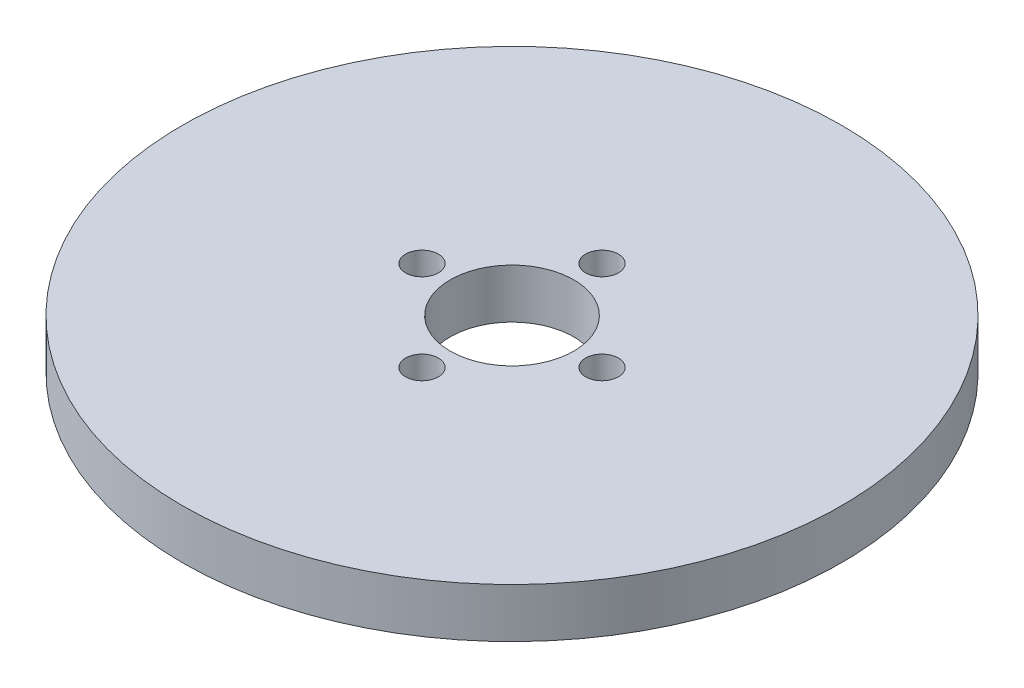
ISO-10303-21;
HEADER;
FILE_DESCRIPTION(('STEP AP214'),'2;1');
FILE_NAME('part.step','',(''),(''),'','','');
FILE_SCHEMA(('AUTOMOTIVE_DESIGN { 1 0 10303 214 1 1 1 1 }'));
ENDSEC;
DATA;
#1=APPLICATION_CONTEXT('core data for automotive mechanical design processes');
#2=APPLICATION_PROTOCOL_DEFINITION('international standard','automotive_design',2000,#1);
#3=PRODUCT_CONTEXT('',#1,'mechanical');
#4=PRODUCT('Part','Part','',(#3));
#5=PRODUCT_RELATED_PRODUCT_CATEGORY('part','',(#4));
#6=PRODUCT_DEFINITION_FORMATION('','',#4);
#7=PRODUCT_DEFINITION_CONTEXT('part definition',#1,'design');
#8=PRODUCT_DEFINITION('design','',#6,#7);
#9=PRODUCT_DEFINITION_SHAPE('','',#8);
#10=(LENGTH_UNIT() NAMED_UNIT(*) SI_UNIT(.MILLI.,.METRE.));
#11=(NAMED_UNIT(*) PLANE_ANGLE_UNIT() SI_UNIT($,.RADIAN.));
#12=(NAMED_UNIT(*) SI_UNIT($,.STERADIAN.) SOLID_ANGLE_UNIT());
#13=UNCERTAINTY_MEASURE_WITH_UNIT(LENGTH_MEASURE(1.E-05),#10,'distance_accuracy_value','');
#14=(GEOMETRIC_REPRESENTATION_CONTEXT(3) GLOBAL_UNCERTAINTY_ASSIGNED_CONTEXT((#13)) GLOBAL_UNIT_ASSIGNED_CONTEXT((#10,
#11,#12)) REPRESENTATION_CONTEXT('',''));
#15=CARTESIAN_POINT('',(0.,0.,0.));
#16=DIRECTION('',(0.,0.,1.));
#17=DIRECTION('',(1.,0.,0.));
#18=AXIS2_PLACEMENT_3D('',#15,#16,#17);
#19=CARTESIAN_POINT('',(0.,6.,0.));
#20=DIRECTION('',(0.,-1.,0.));
#21=DIRECTION('',(0.,0.,-1.));
#22=AXIS2_PLACEMENT_3D('',#19,#20,#21);
#23=CYLINDRICAL_SURFACE('',#22,40.);
#24=CARTESIAN_POINT('',(0.,6.,0.));
#25=DIRECTION('',(0.,1.,0.));
#26=DIRECTION('',(0.,0.,1.));
#27=AXIS2_PLACEMENT_3D('',#24,#25,#26);
#28=CIRCLE('',#27,40.);
#29=CARTESIAN_POINT('',(0.,6.,40.));
#30=VERTEX_POINT('',#29);
#31=EDGE_CURVE('E10',#30,#30,#28,.T.);
#32=ORIENTED_EDGE('',*,*,#31,.F.);
#33=EDGE_LOOP('',(#32));
#34=FACE_BOUND('',#33,.T.);
#35=CARTESIAN_POINT('',(0.,0.,0.));
#36=DIRECTION('',(0.,1.,0.));
#37=DIRECTION('',(0.,0.,1.));
#38=AXIS2_PLACEMENT_3D('',#35,#36,#37);
#39=CIRCLE('',#38,40.);
#40=CARTESIAN_POINT('',(0.,0.,40.));
#41=VERTEX_POINT('',#40);
#42=EDGE_CURVE('E37',#41,#41,#39,.T.);
#43=ORIENTED_EDGE('',*,*,#42,.T.);
#44=EDGE_LOOP('',(#43));
#45=FACE_BOUND('',#44,.T.);
#46=ADVANCED_FACE('F40',(#34,#45),#23,.T.);
#47=CARTESIAN_POINT('',(0.,6.,0.));
#48=DIRECTION('',(0.,1.,0.));
#49=DIRECTION('',(0.,0.,1.));
#50=AXIS2_PLACEMENT_3D('',#47,#48,#49);
#51=PLANE('',#50);
#52=CARTESIAN_POINT('',(0.,6.,10.9255958646627));
#53=DIRECTION('',(0.,1.,0.));
#54=DIRECTION('',(1.,0.,0.));
#55=AXIS2_PLACEMENT_3D('',#52,#53,#54);
#56=CIRCLE('',#55,1.98590873799821);
#57=CARTESIAN_POINT('',(1.98590873799825,6.,10.9255958646627));
#58=VERTEX_POINT('',#57);
#59=EDGE_CURVE('E71',#58,#58,#56,.T.);
#60=ORIENTED_EDGE('',*,*,#59,.F.);
#61=EDGE_LOOP('',(#60));
#62=FACE_BOUND('',#61,.T.);
#63=CARTESIAN_POINT('',(10.9255958646627,6.,0.));
#64=DIRECTION('',(0.,1.,0.));
#65=DIRECTION('',(0.,0.,-1.));
#66=AXIS2_PLACEMENT_3D('',#63,#64,#65);
#67=CIRCLE('',#66,1.98590873799821);
#68=CARTESIAN_POINT('',(10.9255958646627,6.,-1.98590873799821));
#69=VERTEX_POINT('',#68);
#70=EDGE_CURVE('E70',#69,#69,#67,.T.);
#71=ORIENTED_EDGE('',*,*,#70,.F.);
#72=EDGE_LOOP('',(#71));
#73=FACE_BOUND('',#72,.T.);
#74=CARTESIAN_POINT('',(-1.14439542231635E-13,6.,-10.9255958646627));
#75=DIRECTION('',(0.,1.,0.));
#76=DIRECTION('',(-1.,0.,0.));
#77=AXIS2_PLACEMENT_3D('',#74,#75,#76);
#78=CIRCLE('',#77,1.98590873799821);
#79=CARTESIAN_POINT('',(-1.98590873799833,6.,-10.9255958646627));
#80=VERTEX_POINT('',#79);
#81=EDGE_CURVE('E61',#80,#80,#78,.T.);
#82=ORIENTED_EDGE('',*,*,#81,.F.);
#83=EDGE_LOOP('',(#82));
#84=FACE_BOUND('',#83,.T.);
#85=CARTESIAN_POINT('',(-10.9255958646627,6.,0.));
#86=DIRECTION('',(0.,1.,0.));
#87=DIRECTION('',(0.,0.,1.));
#88=AXIS2_PLACEMENT_3D('',#85,#86,#87);
#89=CIRCLE('',#88,1.98590873799821);
#90=CARTESIAN_POINT('',(-10.9255958646627,6.,1.98590873799821));
#91=VERTEX_POINT('',#90);
#92=EDGE_CURVE('E54',#91,#91,#89,.T.);
#93=ORIENTED_EDGE('',*,*,#92,.F.);
#94=EDGE_LOOP('',(#93));
#95=FACE_BOUND('',#94,.T.);
#96=CARTESIAN_POINT('',(0.,6.,0.));
#97=DIRECTION('',(0.,1.,0.));
#98=DIRECTION('',(0.,0.,1.));
#99=AXIS2_PLACEMENT_3D('',#96,#97,#98);
#100=CIRCLE('',#99,7.5);
#101=CARTESIAN_POINT('',(0.,6.,7.5));
#102=VERTEX_POINT('',#101);
#103=EDGE_CURVE('E50',#102,#102,#100,.T.);
#104=ORIENTED_EDGE('',*,*,#103,.F.);
#105=EDGE_LOOP('',(#104));
#106=FACE_BOUND('',#105,.T.);
#107=ORIENTED_EDGE('',*,*,#31,.T.);
#108=EDGE_LOOP('',(#107));
#109=FACE_BOUND('',#108,.T.);
#110=ADVANCED_FACE('F86',(#62,#73,#84,#95,#106,#109),#51,.T.);
#111=CARTESIAN_POINT('',(0.,0.,0.));
#112=DIRECTION('',(0.,1.,0.));
#113=DIRECTION('',(0.,0.,1.));
#114=AXIS2_PLACEMENT_3D('',#111,#112,#113);
#115=PLANE('',#114);
#116=CARTESIAN_POINT('',(0.,0.,0.));
#117=DIRECTION('',(0.,1.,0.));
#118=DIRECTION('',(0.,0.,1.));
#119=AXIS2_PLACEMENT_3D('',#116,#117,#118);
#120=CIRCLE('',#119,7.5);
#121=CARTESIAN_POINT('',(0.,0.,7.5));
#122=VERTEX_POINT('',#121);
#123=EDGE_CURVE('E47',#122,#122,#120,.T.);
#124=ORIENTED_EDGE('',*,*,#123,.T.);
#125=EDGE_LOOP('',(#124));
#126=FACE_BOUND('',#125,.T.);
#127=ORIENTED_EDGE('',*,*,#42,.F.);
#128=EDGE_LOOP('',(#127));
#129=FACE_BOUND('',#128,.T.);
#130=ADVANCED_FACE('F93',(#126,#129),#115,.F.);
#131=CARTESIAN_POINT('',(0.,6.,0.));
#132=DIRECTION('',(0.,-1.,0.));
#133=DIRECTION('',(0.,0.,-1.));
#134=AXIS2_PLACEMENT_3D('',#131,#132,#133);
#135=CYLINDRICAL_SURFACE('',#134,7.5);
#136=ORIENTED_EDGE('',*,*,#103,.T.);
#137=EDGE_LOOP('',(#136));
#138=FACE_BOUND('',#137,.T.);
#139=ORIENTED_EDGE('',*,*,#123,.F.);
#140=EDGE_LOOP('',(#139));
#141=FACE_BOUND('',#140,.T.);
#142=ADVANCED_FACE('F101',(#138,#141),#135,.F.);
#143=CARTESIAN_POINT('',(-10.9255958646627,1.04640118456503,0.));
#144=DIRECTION('',(0.,1.,0.));
#145=DIRECTION('',(0.,0.,1.));
#146=AXIS2_PLACEMENT_3D('',#143,#144,#145);
#147=CYLINDRICAL_SURFACE('',#146,1.98590873799821);
#148=CARTESIAN_POINT('',(-10.9255958646627,1.04640118456503,0.));
#149=DIRECTION('',(0.,1.,0.));
#150=DIRECTION('',(0.,0.,1.));
#151=AXIS2_PLACEMENT_3D('',#148,#149,#150);
#152=CIRCLE('',#151,1.98590873799821);
#153=CARTESIAN_POINT('',(-10.9255958646627,1.04640118456503,1.98590873799821));
#154=VERTEX_POINT('',#153);
#155=EDGE_CURVE('E55',#154,#154,#152,.T.);
#156=ORIENTED_EDGE('',*,*,#155,.F.);
#157=EDGE_LOOP('',(#156));
#158=FACE_BOUND('',#157,.T.);
#159=ORIENTED_EDGE('',*,*,#92,.T.);
#160=EDGE_LOOP('',(#159));
#161=FACE_BOUND('',#160,.T.);
#162=ADVANCED_FACE('F102',(#158,#161),#147,.F.);
#163=CARTESIAN_POINT('',(-10.9255958646627,1.04640118456503,0.));
#164=DIRECTION('',(0.,1.,0.));
#165=DIRECTION('',(0.,0.,1.));
#166=AXIS2_PLACEMENT_3D('',#163,#164,#165);
#167=PLANE('',#166);
#168=ORIENTED_EDGE('',*,*,#155,.T.);
#169=EDGE_LOOP('',(#168));
#170=FACE_BOUND('',#169,.T.);
#171=ADVANCED_FACE('F133',(#170),#167,.T.);
#172=CARTESIAN_POINT('',(-1.14439542231635E-13,1.04640118456503,-10.9255958646627));
#173=DIRECTION('',(0.,1.,0.));
#174=DIRECTION('',(0.,0.,1.));
#175=AXIS2_PLACEMENT_3D('',#172,#173,#174);
#176=CYLINDRICAL_SURFACE('',#175,1.98590873799821);
#177=CARTESIAN_POINT('',(-1.14439542231635E-13,1.04640118456503,-10.9255958646627));
#178=DIRECTION('',(0.,1.,0.));
#179=DIRECTION('',(-1.,0.,0.));
#180=AXIS2_PLACEMENT_3D('',#177,#178,#179);
#181=CIRCLE('',#180,1.98590873799821);
#182=CARTESIAN_POINT('',(-1.98590873799833,1.04640118456503,-10.9255958646627));
#183=VERTEX_POINT('',#182);
#184=EDGE_CURVE('E63',#183,#183,#181,.T.);
#185=ORIENTED_EDGE('',*,*,#184,.F.);
#186=EDGE_LOOP('',(#185));
#187=FACE_BOUND('',#186,.T.);
#188=ORIENTED_EDGE('',*,*,#81,.T.);
#189=EDGE_LOOP('',(#188));
#190=FACE_BOUND('',#189,.T.);
#191=ADVANCED_FACE('F142',(#187,#190),#176,.F.);
#192=CARTESIAN_POINT('',(-1.14439542231635E-13,1.04640118456503,-10.9255958646627));
#193=DIRECTION('',(0.,1.,0.));
#194=DIRECTION('',(-1.,0.,0.));
#195=AXIS2_PLACEMENT_3D('',#192,#193,#194);
#196=PLANE('',#195);
#197=ORIENTED_EDGE('',*,*,#184,.T.);
#198=EDGE_LOOP('',(#197));
#199=FACE_BOUND('',#198,.T.);
#200=ADVANCED_FACE('F156',(#199),#196,.T.);
#201=CARTESIAN_POINT('',(10.9255958646627,1.04640118456503,0.));
#202=DIRECTION('',(0.,1.,0.));
#203=DIRECTION('',(0.,0.,1.));
#204=AXIS2_PLACEMENT_3D('',#201,#202,#203);
#205=CYLINDRICAL_SURFACE('',#204,1.98590873799821);
#206=CARTESIAN_POINT('',(10.9255958646627,1.04640118456503,0.));
#207=DIRECTION('',(0.,1.,0.));
#208=DIRECTION('',(0.,0.,-1.));
#209=AXIS2_PLACEMENT_3D('',#206,#207,#208);
#210=CIRCLE('',#209,1.98590873799821);
#211=CARTESIAN_POINT('',(10.9255958646627,1.04640118456503,-1.98590873799821));
#212=VERTEX_POINT('',#211);
#213=EDGE_CURVE('E69',#212,#212,#210,.T.);
#214=ORIENTED_EDGE('',*,*,#213,.F.);
#215=EDGE_LOOP('',(#214));
#216=FACE_BOUND('',#215,.T.);
#217=ORIENTED_EDGE('',*,*,#70,.T.);
#218=EDGE_LOOP('',(#217));
#219=FACE_BOUND('',#218,.T.);
#220=ADVANCED_FACE('F164',(#216,#219),#205,.F.);
#221=CARTESIAN_POINT('',(10.9255958646627,1.04640118456503,0.));
#222=DIRECTION('',(0.,1.,0.));
#223=DIRECTION('',(0.,0.,-1.));
#224=AXIS2_PLACEMENT_3D('',#221,#222,#223);
#225=PLANE('',#224);
#226=ORIENTED_EDGE('',*,*,#213,.T.);
#227=EDGE_LOOP('',(#226));
#228=FACE_BOUND('',#227,.T.);
#229=ADVANCED_FACE('F83',(#228),#225,.T.);
#230=CARTESIAN_POINT('',(0.,1.04640118456503,10.9255958646627));
#231=DIRECTION('',(0.,1.,0.));
#232=DIRECTION('',(0.,0.,1.));
#233=AXIS2_PLACEMENT_3D('',#230,#231,#232);
#234=CYLINDRICAL_SURFACE('',#233,1.98590873799821);
#235=CARTESIAN_POINT('',(0.,1.04640118456503,10.9255958646627));
#236=DIRECTION('',(0.,1.,0.));
#237=DIRECTION('',(1.,0.,0.));
#238=AXIS2_PLACEMENT_3D('',#235,#236,#237);
#239=CIRCLE('',#238,1.98590873799821);
#240=CARTESIAN_POINT('',(1.98590873799825,1.04640118456503,10.9255958646627));
#241=VERTEX_POINT('',#240);
#242=EDGE_CURVE('E59',#241,#241,#239,.T.);
#243=ORIENTED_EDGE('',*,*,#242,.F.);
#244=EDGE_LOOP('',(#243));
#245=FACE_BOUND('',#244,.T.);
#246=ORIENTED_EDGE('',*,*,#59,.T.);
#247=EDGE_LOOP('',(#246));
#248=FACE_BOUND('',#247,.T.);
#249=ADVANCED_FACE('F81',(#245,#248),#234,.F.);
#250=CARTESIAN_POINT('',(0.,1.04640118456503,10.9255958646627));
#251=DIRECTION('',(0.,1.,0.));
#252=DIRECTION('',(1.,0.,0.));
#253=AXIS2_PLACEMENT_3D('',#250,#251,#252);
#254=PLANE('',#253);
#255=ORIENTED_EDGE('',*,*,#242,.T.);
#256=EDGE_LOOP('',(#255));
#257=FACE_BOUND('',#256,.T.);
#258=ADVANCED_FACE('F78',(#257),#254,.T.);
#259=CLOSED_SHELL('',(#46,#110,#130,#142,#162,#171,#191,#200,#220,#229,#249,#258));
#260=MANIFOLD_SOLID_BREP('B2',#259);
#261=ADVANCED_BREP_SHAPE_REPRESENTATION('',(#18,#260),#14);
#262=SHAPE_DEFINITION_REPRESENTATION(#9,#261);
ENDSEC;
END-ISO-10303-21;
